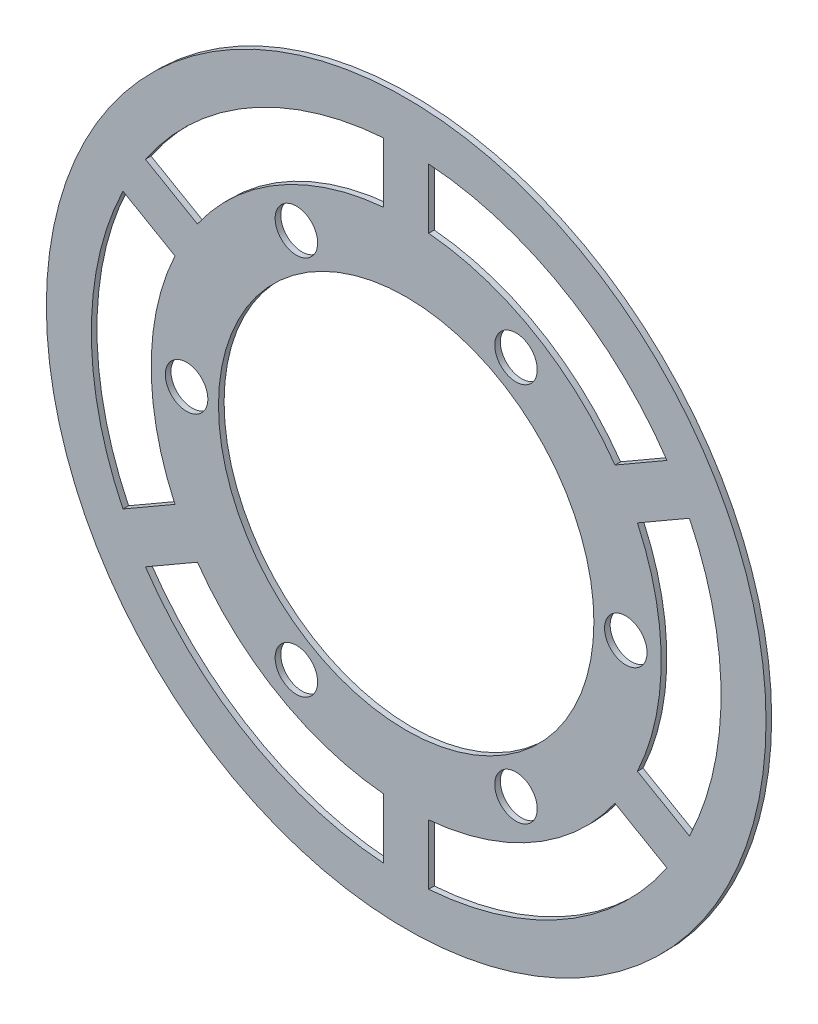
ISO-10303-21;
HEADER;
FILE_DESCRIPTION(('STEP AP214'),'2;1');
FILE_NAME('part.step','',(''),(''),'','','');
FILE_SCHEMA(('AUTOMOTIVE_DESIGN { 1 0 10303 214 1 1 1 1 }'));
ENDSEC;
DATA;
#1=APPLICATION_CONTEXT('core data for automotive mechanical design processes');
#2=APPLICATION_PROTOCOL_DEFINITION('international standard','automotive_design',2000,#1);
#3=PRODUCT_CONTEXT('',#1,'mechanical');
#4=PRODUCT('Part','Part','',(#3));
#5=PRODUCT_RELATED_PRODUCT_CATEGORY('part','',(#4));
#6=PRODUCT_DEFINITION_FORMATION('','',#4);
#7=PRODUCT_DEFINITION_CONTEXT('part definition',#1,'design');
#8=PRODUCT_DEFINITION('design','',#6,#7);
#9=PRODUCT_DEFINITION_SHAPE('','',#8);
#10=(LENGTH_UNIT() NAMED_UNIT(*) SI_UNIT(.MILLI.,.METRE.));
#11=(NAMED_UNIT(*) PLANE_ANGLE_UNIT() SI_UNIT($,.RADIAN.));
#12=(NAMED_UNIT(*) SI_UNIT($,.STERADIAN.) SOLID_ANGLE_UNIT());
#13=UNCERTAINTY_MEASURE_WITH_UNIT(LENGTH_MEASURE(1.E-05),#10,'distance_accuracy_value','');
#14=(GEOMETRIC_REPRESENTATION_CONTEXT(3) GLOBAL_UNCERTAINTY_ASSIGNED_CONTEXT((#13)) GLOBAL_UNIT_ASSIGNED_CONTEXT((#10,
#11,#12)) REPRESENTATION_CONTEXT('',''));
#15=CARTESIAN_POINT('',(0.,0.,0.));
#16=DIRECTION('',(0.,0.,1.));
#17=DIRECTION('',(1.,0.,0.));
#18=AXIS2_PLACEMENT_3D('',#15,#16,#17);
#19=CARTESIAN_POINT('',(0.,0.,0.396875));
#20=DIRECTION('',(0.,0.,-1.));
#21=DIRECTION('',(-1.,0.,0.));
#22=AXIS2_PLACEMENT_3D('',#19,#20,#21);
#23=CYLINDRICAL_SURFACE('',#22,22.225);
#24=CARTESIAN_POINT('',(0.,0.,0.));
#25=DIRECTION('',(0.,0.,1.));
#26=DIRECTION('',(1.,0.,0.));
#27=AXIS2_PLACEMENT_3D('',#24,#25,#26);
#28=CIRCLE('',#27,22.225);
#29=CARTESIAN_POINT('',(-19.9907523793972,9.71187130812728,0.));
#30=VERTEX_POINT('',#29);
#31=CARTESIAN_POINT('',(-19.9907523793972,-9.71187130812725,0.));
#32=VERTEX_POINT('',#31);
#33=EDGE_CURVE('E317',#30,#32,#28,.T.);
#34=ORIENTED_EDGE('',*,*,#33,.F.);
#35=DIRECTION('',(0.,0.,-1.));
#36=VECTOR('',#35,1.);
#37=CARTESIAN_POINT('',(-19.9907523793972,9.71187130812728,0.396875));
#38=LINE('',#37,#36);
#39=CARTESIAN_POINT('',(-19.9907523793972,9.71187130812728,0.396875));
#40=VERTEX_POINT('',#39);
#41=EDGE_CURVE('E11',#40,#30,#38,.T.);
#42=ORIENTED_EDGE('',*,*,#41,.F.);
#43=CARTESIAN_POINT('',(0.,0.,0.396875));
#44=DIRECTION('',(0.,0.,1.));
#45=DIRECTION('',(1.,0.,0.));
#46=AXIS2_PLACEMENT_3D('',#43,#44,#45);
#47=CIRCLE('',#46,22.225);
#48=CARTESIAN_POINT('',(-19.9907523793972,-9.71187130812725,0.396875));
#49=VERTEX_POINT('',#48);
#50=EDGE_CURVE('E226',#40,#49,#47,.T.);
#51=ORIENTED_EDGE('',*,*,#50,.T.);
#52=DIRECTION('',(0.,0.,-1.));
#53=VECTOR('',#52,1.);
#54=CARTESIAN_POINT('',(-19.9907523793972,-9.71187130812725,0.396875));
#55=LINE('',#54,#53);
#56=EDGE_CURVE('E139',#49,#32,#55,.T.);
#57=ORIENTED_EDGE('',*,*,#56,.T.);
#58=EDGE_LOOP('',(#34,#42,#51,#57));
#59=FACE_BOUND('',#58,.T.);
#60=ADVANCED_FACE('F37',(#59),#23,.F.);
#61=CARTESIAN_POINT('',(-0.792324459287639,-1.37234621956571,0.396875));
#62=DIRECTION('',(-0.500000000000004,-0.866025403784436,0.));
#63=DIRECTION('',(0.866025403784436,-0.500000000000004,0.));
#64=AXIS2_PLACEMENT_3D('',#61,#62,#63);
#65=PLANE('',#64);
#66=DIRECTION('',(-0.866025403784436,0.500000000000004,0.));
#67=VECTOR('',#66,1.);
#68=CARTESIAN_POINT('',(-0.792324459287639,-1.37234621956571,0.));
#69=LINE('',#68,#67);
#70=CARTESIAN_POINT('',(-16.3202562550434,7.59270938267211,0.));
#71=VERTEX_POINT('',#70);
#72=EDGE_CURVE('E215',#71,#30,#69,.T.);
#73=ORIENTED_EDGE('',*,*,#72,.F.);
#74=DIRECTION('',(0.,0.,-1.));
#75=VECTOR('',#74,1.);
#76=CARTESIAN_POINT('',(-16.3202562550434,7.59270938267211,0.396875));
#77=LINE('',#76,#75);
#78=CARTESIAN_POINT('',(-16.3202562550434,7.59270938267211,0.396875));
#79=VERTEX_POINT('',#78);
#80=EDGE_CURVE('E47',#79,#71,#77,.T.);
#81=ORIENTED_EDGE('',*,*,#80,.F.);
#82=DIRECTION('',(-0.866025403784436,0.500000000000004,0.));
#83=VECTOR('',#82,1.);
#84=CARTESIAN_POINT('',(-0.792324459287639,-1.37234621956571,0.396875));
#85=LINE('',#84,#83);
#86=EDGE_CURVE('E213',#79,#40,#85,.T.);
#87=ORIENTED_EDGE('',*,*,#86,.T.);
#88=ORIENTED_EDGE('',*,*,#41,.T.);
#89=EDGE_LOOP('',(#73,#81,#87,#88));
#90=FACE_BOUND('',#89,.T.);
#91=ADVANCED_FACE('F211',(#90),#65,.T.);
#92=CARTESIAN_POINT('',(0.,0.,0.396875));
#93=DIRECTION('',(0.,0.,-1.));
#94=DIRECTION('',(-1.,0.,0.));
#95=AXIS2_PLACEMENT_3D('',#92,#93,#94);
#96=CYLINDRICAL_SURFACE('',#95,18.);
#97=CARTESIAN_POINT('',(0.,0.,0.));
#98=DIRECTION('',(0.,0.,1.));
#99=DIRECTION('',(1.,0.,0.));
#100=AXIS2_PLACEMENT_3D('',#97,#98,#99);
#101=CIRCLE('',#100,18.);
#102=CARTESIAN_POINT('',(-16.3202562550434,-7.5927093826721,0.));
#103=VERTEX_POINT('',#102);
#104=EDGE_CURVE('E320',#71,#103,#101,.T.);
#105=ORIENTED_EDGE('',*,*,#104,.T.);
#106=DIRECTION('',(0.,0.,-1.));
#107=VECTOR('',#106,1.);
#108=CARTESIAN_POINT('',(-16.3202562550434,-7.5927093826721,0.396875));
#109=LINE('',#108,#107);
#110=CARTESIAN_POINT('',(-16.3202562550434,-7.5927093826721,0.396875));
#111=VERTEX_POINT('',#110);
#112=EDGE_CURVE('E218',#111,#103,#109,.T.);
#113=ORIENTED_EDGE('',*,*,#112,.F.);
#114=CARTESIAN_POINT('',(0.,0.,0.396875));
#115=DIRECTION('',(0.,0.,1.));
#116=DIRECTION('',(1.,0.,0.));
#117=AXIS2_PLACEMENT_3D('',#114,#115,#116);
#118=CIRCLE('',#117,18.);
#119=EDGE_CURVE('E221',#79,#111,#118,.T.);
#120=ORIENTED_EDGE('',*,*,#119,.F.);
#121=ORIENTED_EDGE('',*,*,#80,.T.);
#122=EDGE_LOOP('',(#105,#113,#120,#121));
#123=FACE_BOUND('',#122,.T.);
#124=ADVANCED_FACE('F222',(#123),#96,.T.);
#125=CARTESIAN_POINT('',(0.,0.,0.396875));
#126=DIRECTION('',(0.,0.,-1.));
#127=DIRECTION('',(-1.,0.,0.));
#128=AXIS2_PLACEMENT_3D('',#125,#126,#127);
#129=CYLINDRICAL_SURFACE('',#128,22.225);
#130=CARTESIAN_POINT('',(0.,0.,0.));
#131=DIRECTION('',(0.,0.,1.));
#132=DIRECTION('',(1.,0.,0.));
#133=AXIS2_PLACEMENT_3D('',#130,#131,#132);
#134=CIRCLE('',#133,22.225);
#135=CARTESIAN_POINT('',(-18.406103460822,-12.4565637472585,0.));
#136=VERTEX_POINT('',#135);
#137=CARTESIAN_POINT('',(-1.58464891857501,-22.1684350553858,0.));
#138=VERTEX_POINT('',#137);
#139=EDGE_CURVE('E284',#136,#138,#134,.T.);
#140=ORIENTED_EDGE('',*,*,#139,.F.);
#141=DIRECTION('',(0.,0.,-1.));
#142=VECTOR('',#141,1.);
#143=CARTESIAN_POINT('',(-18.406103460822,-12.4565637472585,0.396875));
#144=LINE('',#143,#142);
#145=CARTESIAN_POINT('',(-18.406103460822,-12.4565637472585,0.396875));
#146=VERTEX_POINT('',#145);
#147=EDGE_CURVE('E328',#146,#136,#144,.T.);
#148=ORIENTED_EDGE('',*,*,#147,.F.);
#149=CARTESIAN_POINT('',(0.,0.,0.396875));
#150=DIRECTION('',(0.,0.,1.));
#151=DIRECTION('',(1.,0.,0.));
#152=AXIS2_PLACEMENT_3D('',#149,#150,#151);
#153=CIRCLE('',#152,22.225);
#154=CARTESIAN_POINT('',(-1.58464891857501,-22.1684350553858,0.396875));
#155=VERTEX_POINT('',#154);
#156=EDGE_CURVE('E428',#146,#155,#153,.T.);
#157=ORIENTED_EDGE('',*,*,#156,.T.);
#158=DIRECTION('',(0.,0.,-1.));
#159=VECTOR('',#158,1.);
#160=CARTESIAN_POINT('',(-1.58464891857501,-22.1684350553858,0.396875));
#161=LINE('',#160,#159);
#162=EDGE_CURVE('E330',#155,#138,#161,.T.);
#163=ORIENTED_EDGE('',*,*,#162,.T.);
#164=EDGE_LOOP('',(#140,#148,#157,#163));
#165=FACE_BOUND('',#164,.T.);
#166=ADVANCED_FACE('F521',(#165),#129,.F.);
#167=CARTESIAN_POINT('',(0.792324459287577,-1.37234621956563,0.396875));
#168=DIRECTION('',(0.499999999999999,-0.866025403784439,0.));
#169=DIRECTION('',(0.86602540378444,0.499999999999999,0.));
#170=AXIS2_PLACEMENT_3D('',#167,#168,#169);
#171=PLANE('',#170);
#172=DIRECTION('',(-0.86602540378444,-0.499999999999999,0.));
#173=VECTOR('',#172,1.);
#174=CARTESIAN_POINT('',(0.792324459287577,-1.37234621956563,0.));
#175=LINE('',#174,#173);
#176=CARTESIAN_POINT('',(-14.7356073364682,-10.3374018218034,0.));
#177=VERTEX_POINT('',#176);
#178=EDGE_CURVE('E287',#177,#136,#175,.T.);
#179=ORIENTED_EDGE('',*,*,#178,.F.);
#180=DIRECTION('',(0.,0.,-1.));
#181=VECTOR('',#180,1.);
#182=CARTESIAN_POINT('',(-14.7356073364682,-10.3374018218034,0.396875));
#183=LINE('',#182,#181);
#184=CARTESIAN_POINT('',(-14.7356073364682,-10.3374018218034,0.396875));
#185=VERTEX_POINT('',#184);
#186=EDGE_CURVE('E336',#185,#177,#183,.T.);
#187=ORIENTED_EDGE('',*,*,#186,.F.);
#188=DIRECTION('',(-0.86602540378444,-0.499999999999999,0.));
#189=VECTOR('',#188,1.);
#190=CARTESIAN_POINT('',(0.792324459287577,-1.37234621956563,0.396875));
#191=LINE('',#190,#189);
#192=EDGE_CURVE('E431',#185,#146,#191,.T.);
#193=ORIENTED_EDGE('',*,*,#192,.T.);
#194=ORIENTED_EDGE('',*,*,#147,.T.);
#195=EDGE_LOOP('',(#179,#187,#193,#194));
#196=FACE_BOUND('',#195,.T.);
#197=ADVANCED_FACE('F517',(#196),#171,.T.);
#198=CARTESIAN_POINT('',(0.,0.,0.396875));
#199=DIRECTION('',(0.,0.,-1.));
#200=DIRECTION('',(-1.,0.,0.));
#201=AXIS2_PLACEMENT_3D('',#198,#199,#200);
#202=CYLINDRICAL_SURFACE('',#201,18.);
#203=CARTESIAN_POINT('',(0.,0.,0.));
#204=DIRECTION('',(0.,0.,1.));
#205=DIRECTION('',(1.,0.,0.));
#206=AXIS2_PLACEMENT_3D('',#203,#204,#205);
#207=CIRCLE('',#206,18.);
#208=CARTESIAN_POINT('',(-1.58464891857501,-17.9301112044755,0.));
#209=VERTEX_POINT('',#208);
#210=EDGE_CURVE('E290',#177,#209,#207,.T.);
#211=ORIENTED_EDGE('',*,*,#210,.T.);
#212=DIRECTION('',(0.,0.,-1.));
#213=VECTOR('',#212,1.);
#214=CARTESIAN_POINT('',(-1.58464891857501,-17.9301112044755,0.396875));
#215=LINE('',#214,#213);
#216=CARTESIAN_POINT('',(-1.58464891857501,-17.9301112044755,0.396875));
#217=VERTEX_POINT('',#216);
#218=EDGE_CURVE('E332',#217,#209,#215,.T.);
#219=ORIENTED_EDGE('',*,*,#218,.F.);
#220=CARTESIAN_POINT('',(0.,0.,0.396875));
#221=DIRECTION('',(0.,0.,1.));
#222=DIRECTION('',(1.,0.,0.));
#223=AXIS2_PLACEMENT_3D('',#220,#221,#222);
#224=CIRCLE('',#223,18.);
#225=EDGE_CURVE('E434',#185,#217,#224,.T.);
#226=ORIENTED_EDGE('',*,*,#225,.F.);
#227=ORIENTED_EDGE('',*,*,#186,.T.);
#228=EDGE_LOOP('',(#211,#219,#226,#227));
#229=FACE_BOUND('',#228,.T.);
#230=ADVANCED_FACE('F513',(#229),#202,.T.);
#231=CARTESIAN_POINT('',(0.,0.,0.396875));
#232=DIRECTION('',(0.,0.,-1.));
#233=DIRECTION('',(-1.,0.,0.));
#234=AXIS2_PLACEMENT_3D('',#231,#232,#233);
#235=CYLINDRICAL_SURFACE('',#234,22.225);
#236=CARTESIAN_POINT('',(0.,0.,0.));
#237=DIRECTION('',(0.,0.,1.));
#238=DIRECTION('',(1.,0.,0.));
#239=AXIS2_PLACEMENT_3D('',#236,#237,#238);
#240=CIRCLE('',#239,22.225);
#241=CARTESIAN_POINT('',(1.58464891857501,-22.1684350553858,0.));
#242=VERTEX_POINT('',#241);
#243=CARTESIAN_POINT('',(18.4061034608221,-12.4565637472584,0.));
#244=VERTEX_POINT('',#243);
#245=EDGE_CURVE('E272',#242,#244,#240,.T.);
#246=ORIENTED_EDGE('',*,*,#245,.F.);
#247=DIRECTION('',(0.,0.,-1.));
#248=VECTOR('',#247,1.);
#249=CARTESIAN_POINT('',(1.58464891857501,-22.1684350553858,0.396875));
#250=LINE('',#249,#248);
#251=CARTESIAN_POINT('',(1.58464891857501,-22.1684350553858,0.396875));
#252=VERTEX_POINT('',#251);
#253=EDGE_CURVE('E333',#252,#242,#250,.T.);
#254=ORIENTED_EDGE('',*,*,#253,.F.);
#255=CARTESIAN_POINT('',(0.,0.,0.396875));
#256=DIRECTION('',(0.,0.,1.));
#257=DIRECTION('',(1.,0.,0.));
#258=AXIS2_PLACEMENT_3D('',#255,#256,#257);
#259=CIRCLE('',#258,22.225);
#260=CARTESIAN_POINT('',(18.4061034608221,-12.4565637472584,0.396875));
#261=VERTEX_POINT('',#260);
#262=EDGE_CURVE('E417',#252,#261,#259,.T.);
#263=ORIENTED_EDGE('',*,*,#262,.T.);
#264=DIRECTION('',(0.,0.,-1.));
#265=VECTOR('',#264,1.);
#266=CARTESIAN_POINT('',(18.4061034608221,-12.4565637472584,0.396875));
#267=LINE('',#266,#265);
#268=EDGE_CURVE('E339',#261,#244,#267,.T.);
#269=ORIENTED_EDGE('',*,*,#268,.T.);
#270=EDGE_LOOP('',(#246,#254,#263,#269));
#271=FACE_BOUND('',#270,.T.);
#272=ADVANCED_FACE('F516',(#271),#235,.F.);
#273=CARTESIAN_POINT('',(1.58464891857562,0.,0.396875));
#274=DIRECTION('',(1.,0.,0.));
#275=DIRECTION('',(0.,1.,0.));
#276=AXIS2_PLACEMENT_3D('',#273,#274,#275);
#277=PLANE('',#276);
#278=DIRECTION('',(0.,-1.,0.));
#279=VECTOR('',#278,1.);
#280=CARTESIAN_POINT('',(1.58464891857562,0.,0.));
#281=LINE('',#280,#279);
#282=CARTESIAN_POINT('',(1.58464891857513,-17.9301112044755,0.));
#283=VERTEX_POINT('',#282);
#284=EDGE_CURVE('E275',#283,#242,#281,.T.);
#285=ORIENTED_EDGE('',*,*,#284,.F.);
#286=DIRECTION('',(0.,0.,-1.));
#287=VECTOR('',#286,1.);
#288=CARTESIAN_POINT('',(1.58464891857513,-17.9301112044755,0.396875));
#289=LINE('',#288,#287);
#290=CARTESIAN_POINT('',(1.58464891857513,-17.9301112044755,0.396875));
#291=VERTEX_POINT('',#290);
#292=EDGE_CURVE('E345',#291,#283,#289,.T.);
#293=ORIENTED_EDGE('',*,*,#292,.F.);
#294=DIRECTION('',(0.,-1.,0.));
#295=VECTOR('',#294,1.);
#296=CARTESIAN_POINT('',(1.58464891857562,0.,0.396875));
#297=LINE('',#296,#295);
#298=EDGE_CURVE('E420',#291,#252,#297,.T.);
#299=ORIENTED_EDGE('',*,*,#298,.T.);
#300=ORIENTED_EDGE('',*,*,#253,.T.);
#301=EDGE_LOOP('',(#285,#293,#299,#300));
#302=FACE_BOUND('',#301,.T.);
#303=ADVANCED_FACE('F534',(#302),#277,.T.);
#304=CARTESIAN_POINT('',(0.,0.,0.396875));
#305=DIRECTION('',(0.,0.,-1.));
#306=DIRECTION('',(-1.,0.,0.));
#307=AXIS2_PLACEMENT_3D('',#304,#305,#306);
#308=CYLINDRICAL_SURFACE('',#307,18.);
#309=CARTESIAN_POINT('',(0.,0.,0.));
#310=DIRECTION('',(0.,0.,1.));
#311=DIRECTION('',(1.,0.,0.));
#312=AXIS2_PLACEMENT_3D('',#309,#310,#311);
#313=CIRCLE('',#312,18.);
#314=CARTESIAN_POINT('',(14.7356073364683,-10.3374018218032,0.));
#315=VERTEX_POINT('',#314);
#316=EDGE_CURVE('E278',#283,#315,#313,.T.);
#317=ORIENTED_EDGE('',*,*,#316,.T.);
#318=DIRECTION('',(0.,0.,-1.));
#319=VECTOR('',#318,1.);
#320=CARTESIAN_POINT('',(14.7356073364683,-10.3374018218032,0.396875));
#321=LINE('',#320,#319);
#322=CARTESIAN_POINT('',(14.7356073364683,-10.3374018218032,0.396875));
#323=VERTEX_POINT('',#322);
#324=EDGE_CURVE('E341',#323,#315,#321,.T.);
#325=ORIENTED_EDGE('',*,*,#324,.F.);
#326=CARTESIAN_POINT('',(0.,0.,0.396875));
#327=DIRECTION('',(0.,0.,1.));
#328=DIRECTION('',(1.,0.,0.));
#329=AXIS2_PLACEMENT_3D('',#326,#327,#328);
#330=CIRCLE('',#329,18.);
#331=EDGE_CURVE('E423',#291,#323,#330,.T.);
#332=ORIENTED_EDGE('',*,*,#331,.F.);
#333=ORIENTED_EDGE('',*,*,#292,.T.);
#334=EDGE_LOOP('',(#317,#325,#332,#333));
#335=FACE_BOUND('',#334,.T.);
#336=ADVANCED_FACE('F530',(#335),#308,.T.);
#337=CARTESIAN_POINT('',(0.,0.,0.396875));
#338=DIRECTION('',(0.,0.,-1.));
#339=DIRECTION('',(-1.,0.,0.));
#340=AXIS2_PLACEMENT_3D('',#337,#338,#339);
#341=CYLINDRICAL_SURFACE('',#340,22.225);
#342=CARTESIAN_POINT('',(0.,0.,0.));
#343=DIRECTION('',(0.,0.,1.));
#344=DIRECTION('',(1.,0.,0.));
#345=AXIS2_PLACEMENT_3D('',#342,#343,#344);
#346=CIRCLE('',#345,22.225);
#347=CARTESIAN_POINT('',(19.990752379397,-9.71187130812762,0.));
#348=VERTEX_POINT('',#347);
#349=CARTESIAN_POINT('',(19.9907523793971,9.71187130812751,0.));
#350=VERTEX_POINT('',#349);
#351=EDGE_CURVE('E260',#348,#350,#346,.T.);
#352=ORIENTED_EDGE('',*,*,#351,.F.);
#353=DIRECTION('',(0.,0.,-1.));
#354=VECTOR('',#353,1.);
#355=CARTESIAN_POINT('',(19.990752379397,-9.71187130812762,0.396875));
#356=LINE('',#355,#354);
#357=CARTESIAN_POINT('',(19.990752379397,-9.71187130812762,0.396875));
#358=VERTEX_POINT('',#357);
#359=EDGE_CURVE('E342',#358,#348,#356,.T.);
#360=ORIENTED_EDGE('',*,*,#359,.F.);
#361=CARTESIAN_POINT('',(0.,0.,0.396875));
#362=DIRECTION('',(0.,0.,1.));
#363=DIRECTION('',(1.,0.,0.));
#364=AXIS2_PLACEMENT_3D('',#361,#362,#363);
#365=CIRCLE('',#364,22.225);
#366=CARTESIAN_POINT('',(19.9907523793971,9.71187130812751,0.396875));
#367=VERTEX_POINT('',#366);
#368=EDGE_CURVE('E406',#358,#367,#365,.T.);
#369=ORIENTED_EDGE('',*,*,#368,.T.);
#370=DIRECTION('',(0.,0.,-1.));
#371=VECTOR('',#370,1.);
#372=CARTESIAN_POINT('',(19.9907523793971,9.71187130812751,0.396875));
#373=LINE('',#372,#371);
#374=EDGE_CURVE('E348',#367,#350,#373,.T.);
#375=ORIENTED_EDGE('',*,*,#374,.T.);
#376=EDGE_LOOP('',(#352,#360,#369,#375));
#377=FACE_BOUND('',#376,.T.);
#378=ADVANCED_FACE('F533',(#377),#341,.F.);
#379=CARTESIAN_POINT('',(0.792324459287454,1.37234621956539,0.396875));
#380=DIRECTION('',(0.500000000000004,0.866025403784436,0.));
#381=DIRECTION('',(-0.866025403784436,0.500000000000004,0.));
#382=AXIS2_PLACEMENT_3D('',#379,#380,#381);
#383=PLANE('',#382);
#384=DIRECTION('',(0.866025403784436,-0.500000000000004,0.));
#385=VECTOR('',#384,1.);
#386=CARTESIAN_POINT('',(0.792324459287454,1.37234621956539,0.));
#387=LINE('',#386,#385);
#388=CARTESIAN_POINT('',(16.3202562550432,-7.59270938267245,0.));
#389=VERTEX_POINT('',#388);
#390=EDGE_CURVE('E263',#389,#348,#387,.T.);
#391=ORIENTED_EDGE('',*,*,#390,.F.);
#392=DIRECTION('',(0.,0.,-1.));
#393=VECTOR('',#392,1.);
#394=CARTESIAN_POINT('',(16.3202562550432,-7.59270938267245,0.396875));
#395=LINE('',#394,#393);
#396=CARTESIAN_POINT('',(16.3202562550432,-7.59270938267245,0.396875));
#397=VERTEX_POINT('',#396);
#398=EDGE_CURVE('E354',#397,#389,#395,.T.);
#399=ORIENTED_EDGE('',*,*,#398,.F.);
#400=DIRECTION('',(0.866025403784436,-0.500000000000004,0.));
#401=VECTOR('',#400,1.);
#402=CARTESIAN_POINT('',(0.792324459287454,1.37234621956539,0.396875));
#403=LINE('',#402,#401);
#404=EDGE_CURVE('E409',#397,#358,#403,.T.);
#405=ORIENTED_EDGE('',*,*,#404,.T.);
#406=ORIENTED_EDGE('',*,*,#359,.T.);
#407=EDGE_LOOP('',(#391,#399,#405,#406));
#408=FACE_BOUND('',#407,.T.);
#409=ADVANCED_FACE('F550',(#408),#383,.T.);
#410=CARTESIAN_POINT('',(0.,0.,0.396875));
#411=DIRECTION('',(0.,0.,-1.));
#412=DIRECTION('',(-1.,0.,0.));
#413=AXIS2_PLACEMENT_3D('',#410,#411,#412);
#414=CYLINDRICAL_SURFACE('',#413,18.);
#415=CARTESIAN_POINT('',(0.,0.,0.));
#416=DIRECTION('',(0.,0.,1.));
#417=DIRECTION('',(1.,0.,0.));
#418=AXIS2_PLACEMENT_3D('',#415,#416,#417);
#419=CIRCLE('',#418,18.);
#420=CARTESIAN_POINT('',(16.3202562550433,7.59270938267237,0.));
#421=VERTEX_POINT('',#420);
#422=EDGE_CURVE('E266',#389,#421,#419,.T.);
#423=ORIENTED_EDGE('',*,*,#422,.T.);
#424=DIRECTION('',(0.,0.,-1.));
#425=VECTOR('',#424,1.);
#426=CARTESIAN_POINT('',(16.3202562550433,7.59270938267237,0.396875));
#427=LINE('',#426,#425);
#428=CARTESIAN_POINT('',(16.3202562550433,7.59270938267237,0.396875));
#429=VERTEX_POINT('',#428);
#430=EDGE_CURVE('E350',#429,#421,#427,.T.);
#431=ORIENTED_EDGE('',*,*,#430,.F.);
#432=CARTESIAN_POINT('',(0.,0.,0.396875));
#433=DIRECTION('',(0.,0.,1.));
#434=DIRECTION('',(1.,0.,0.));
#435=AXIS2_PLACEMENT_3D('',#432,#433,#434);
#436=CIRCLE('',#435,18.);
#437=EDGE_CURVE('E412',#397,#429,#436,.T.);
#438=ORIENTED_EDGE('',*,*,#437,.F.);
#439=ORIENTED_EDGE('',*,*,#398,.T.);
#440=EDGE_LOOP('',(#423,#431,#438,#439));
#441=FACE_BOUND('',#440,.T.);
#442=ADVANCED_FACE('F546',(#441),#414,.T.);
#443=CARTESIAN_POINT('',(0.,0.,0.396875));
#444=DIRECTION('',(0.,0.,-1.));
#445=DIRECTION('',(-1.,0.,0.));
#446=AXIS2_PLACEMENT_3D('',#443,#444,#445);
#447=CYLINDRICAL_SURFACE('',#446,22.225);
#448=CARTESIAN_POINT('',(0.,0.,0.));
#449=DIRECTION('',(0.,0.,1.));
#450=DIRECTION('',(1.,0.,0.));
#451=AXIS2_PLACEMENT_3D('',#448,#449,#450);
#452=CIRCLE('',#451,22.225);
#453=CARTESIAN_POINT('',(18.4061034608222,12.4565637472583,0.));
#454=VERTEX_POINT('',#453);
#455=CARTESIAN_POINT('',(1.58464891857517,22.1684350553858,0.));
#456=VERTEX_POINT('',#455);
#457=EDGE_CURVE('E248',#454,#456,#452,.T.);
#458=ORIENTED_EDGE('',*,*,#457,.F.);
#459=DIRECTION('',(0.,0.,-1.));
#460=VECTOR('',#459,1.);
#461=CARTESIAN_POINT('',(18.4061034608222,12.4565637472583,0.396875));
#462=LINE('',#461,#460);
#463=CARTESIAN_POINT('',(18.4061034608222,12.4565637472583,0.396875));
#464=VERTEX_POINT('',#463);
#465=EDGE_CURVE('E351',#464,#454,#462,.T.);
#466=ORIENTED_EDGE('',*,*,#465,.F.);
#467=CARTESIAN_POINT('',(0.,0.,0.396875));
#468=DIRECTION('',(0.,0.,1.));
#469=DIRECTION('',(1.,0.,0.));
#470=AXIS2_PLACEMENT_3D('',#467,#468,#469);
#471=CIRCLE('',#470,22.225);
#472=CARTESIAN_POINT('',(1.58464891857517,22.1684350553858,0.396875));
#473=VERTEX_POINT('',#472);
#474=EDGE_CURVE('E390',#464,#473,#471,.T.);
#475=ORIENTED_EDGE('',*,*,#474,.T.);
#476=DIRECTION('',(0.,0.,-1.));
#477=VECTOR('',#476,1.);
#478=CARTESIAN_POINT('',(1.58464891857517,22.1684350553858,0.396875));
#479=LINE('',#478,#477);
#480=EDGE_CURVE('E357',#473,#456,#479,.T.);
#481=ORIENTED_EDGE('',*,*,#480,.T.);
#482=EDGE_LOOP('',(#458,#466,#475,#481));
#483=FACE_BOUND('',#482,.T.);
#484=ADVANCED_FACE('F549',(#483),#447,.F.);
#485=CARTESIAN_POINT('',(-0.792324459287421,1.37234621956536,0.396875));
#486=DIRECTION('',(-0.499999999999999,0.866025403784439,0.));
#487=DIRECTION('',(-0.866025403784439,-0.499999999999999,0.));
#488=AXIS2_PLACEMENT_3D('',#485,#486,#487);
#489=PLANE('',#488);
#490=DIRECTION('',(0.866025403784439,0.499999999999999,0.));
#491=VECTOR('',#490,1.);
#492=CARTESIAN_POINT('',(-0.792324459287421,1.37234621956536,0.));
#493=LINE('',#492,#491);
#494=CARTESIAN_POINT('',(14.7356073364684,10.3374018218031,0.));
#495=VERTEX_POINT('',#494);
#496=EDGE_CURVE('E251',#495,#454,#493,.T.);
#497=ORIENTED_EDGE('',*,*,#496,.F.);
#498=DIRECTION('',(0.,0.,-1.));
#499=VECTOR('',#498,1.);
#500=CARTESIAN_POINT('',(14.7356073364684,10.3374018218031,0.396875));
#501=LINE('',#500,#499);
#502=CARTESIAN_POINT('',(14.7356073364684,10.3374018218031,0.396875));
#503=VERTEX_POINT('',#502);
#504=EDGE_CURVE('E362',#503,#495,#501,.T.);
#505=ORIENTED_EDGE('',*,*,#504,.F.);
#506=DIRECTION('',(0.866025403784439,0.499999999999999,0.));
#507=VECTOR('',#506,1.);
#508=CARTESIAN_POINT('',(-0.792324459287421,1.37234621956536,0.396875));
#509=LINE('',#508,#507);
#510=EDGE_CURVE('E394',#503,#464,#509,.T.);
#511=ORIENTED_EDGE('',*,*,#510,.T.);
#512=ORIENTED_EDGE('',*,*,#465,.T.);
#513=EDGE_LOOP('',(#497,#505,#511,#512));
#514=FACE_BOUND('',#513,.T.);
#515=ADVANCED_FACE('F564',(#514),#489,.T.);
#516=CARTESIAN_POINT('',(0.,0.,0.396875));
#517=DIRECTION('',(0.,0.,-1.));
#518=DIRECTION('',(-1.,0.,0.));
#519=AXIS2_PLACEMENT_3D('',#516,#517,#518);
#520=CYLINDRICAL_SURFACE('',#519,18.);
#521=CARTESIAN_POINT('',(0.,0.,0.));
#522=DIRECTION('',(0.,0.,1.));
#523=DIRECTION('',(1.,0.,0.));
#524=AXIS2_PLACEMENT_3D('',#521,#522,#523);
#525=CIRCLE('',#524,18.);
#526=CARTESIAN_POINT('',(1.58464891857517,17.9301112044755,0.));
#527=VERTEX_POINT('',#526);
#528=EDGE_CURVE('E254',#495,#527,#525,.T.);
#529=ORIENTED_EDGE('',*,*,#528,.T.);
#530=DIRECTION('',(0.,0.,-1.));
#531=VECTOR('',#530,1.);
#532=CARTESIAN_POINT('',(1.58464891857517,17.9301112044755,0.396875));
#533=LINE('',#532,#531);
#534=CARTESIAN_POINT('',(1.58464891857517,17.9301112044755,0.396875));
#535=VERTEX_POINT('',#534);
#536=EDGE_CURVE('E359',#535,#527,#533,.T.);
#537=ORIENTED_EDGE('',*,*,#536,.F.);
#538=CARTESIAN_POINT('',(0.,0.,0.396875));
#539=DIRECTION('',(0.,0.,1.));
#540=DIRECTION('',(1.,0.,0.));
#541=AXIS2_PLACEMENT_3D('',#538,#539,#540);
#542=CIRCLE('',#541,18.);
#543=EDGE_CURVE('E401',#503,#535,#542,.T.);
#544=ORIENTED_EDGE('',*,*,#543,.F.);
#545=ORIENTED_EDGE('',*,*,#504,.T.);
#546=EDGE_LOOP('',(#529,#537,#544,#545));
#547=FACE_BOUND('',#546,.T.);
#548=ADVANCED_FACE('F561',(#547),#520,.T.);
#549=CARTESIAN_POINT('',(0.,0.,0.396875));
#550=DIRECTION('',(0.,0.,-1.));
#551=DIRECTION('',(-1.,0.,0.));
#552=AXIS2_PLACEMENT_3D('',#549,#550,#551);
#553=CYLINDRICAL_SURFACE('',#552,22.225);
#554=CARTESIAN_POINT('',(0.,0.,0.));
#555=DIRECTION('',(0.,0.,1.));
#556=DIRECTION('',(1.,0.,0.));
#557=AXIS2_PLACEMENT_3D('',#554,#555,#556);
#558=CIRCLE('',#557,22.225);
#559=CARTESIAN_POINT('',(-1.58464891857517,22.1684350553858,0.));
#560=VERTEX_POINT('',#559);
#561=CARTESIAN_POINT('',(-18.4061034608219,12.4565637472587,0.));
#562=VERTEX_POINT('',#561);
#563=EDGE_CURVE('E237',#560,#562,#558,.T.);
#564=ORIENTED_EDGE('',*,*,#563,.F.);
#565=DIRECTION('',(0.,0.,-1.));
#566=VECTOR('',#565,1.);
#567=CARTESIAN_POINT('',(-1.58464891857517,22.1684350553858,0.396875));
#568=LINE('',#567,#566);
#569=CARTESIAN_POINT('',(-1.58464891857517,22.1684350553858,0.396875));
#570=VERTEX_POINT('',#569);
#571=EDGE_CURVE('E41',#570,#560,#568,.T.);
#572=ORIENTED_EDGE('',*,*,#571,.F.);
#573=CARTESIAN_POINT('',(0.,0.,0.396875));
#574=DIRECTION('',(0.,0.,1.));
#575=DIRECTION('',(1.,0.,0.));
#576=AXIS2_PLACEMENT_3D('',#573,#574,#575);
#577=CIRCLE('',#576,22.225);
#578=CARTESIAN_POINT('',(-18.4061034608219,12.4565637472587,0.396875));
#579=VERTEX_POINT('',#578);
#580=EDGE_CURVE('E326',#570,#579,#577,.T.);
#581=ORIENTED_EDGE('',*,*,#580,.T.);
#582=DIRECTION('',(0.,0.,-1.));
#583=VECTOR('',#582,1.);
#584=CARTESIAN_POINT('',(-18.4061034608219,12.4565637472587,0.396875));
#585=LINE('',#584,#583);
#586=EDGE_CURVE('E236',#579,#562,#585,.T.);
#587=ORIENTED_EDGE('',*,*,#586,.T.);
#588=EDGE_LOOP('',(#564,#572,#581,#587));
#589=FACE_BOUND('',#588,.T.);
#590=ADVANCED_FACE('F39',(#589),#553,.F.);
#591=CARTESIAN_POINT('',(-1.58464891857517,0.,0.396875));
#592=DIRECTION('',(-1.,0.,0.));
#593=DIRECTION('',(0.,-1.,0.));
#594=AXIS2_PLACEMENT_3D('',#591,#592,#593);
#595=PLANE('',#594);
#596=DIRECTION('',(0.,1.,0.));
#597=VECTOR('',#596,1.);
#598=CARTESIAN_POINT('',(-1.58464891857517,0.,0.));
#599=LINE('',#598,#597);
#600=CARTESIAN_POINT('',(-1.58464891857517,17.9301112044755,0.));
#601=VERTEX_POINT('',#600);
#602=EDGE_CURVE('E240',#601,#560,#599,.T.);
#603=ORIENTED_EDGE('',*,*,#602,.F.);
#604=DIRECTION('',(0.,0.,-1.));
#605=VECTOR('',#604,1.);
#606=CARTESIAN_POINT('',(-1.58464891857517,17.9301112044755,0.396875));
#607=LINE('',#606,#605);
#608=CARTESIAN_POINT('',(-1.58464891857517,17.9301112044755,0.396875));
#609=VERTEX_POINT('',#608);
#610=EDGE_CURVE('E368',#609,#601,#607,.T.);
#611=ORIENTED_EDGE('',*,*,#610,.F.);
#612=DIRECTION('',(0.,1.,0.));
#613=VECTOR('',#612,1.);
#614=CARTESIAN_POINT('',(-1.58464891857517,0.,0.396875));
#615=LINE('',#614,#613);
#616=EDGE_CURVE('E377',#609,#570,#615,.T.);
#617=ORIENTED_EDGE('',*,*,#616,.T.);
#618=ORIENTED_EDGE('',*,*,#571,.T.);
#619=EDGE_LOOP('',(#603,#611,#617,#618));
#620=FACE_BOUND('',#619,.T.);
#621=ADVANCED_FACE('F375',(#620),#595,.T.);
#622=CARTESIAN_POINT('',(0.,0.,0.396875));
#623=DIRECTION('',(0.,0.,-1.));
#624=DIRECTION('',(-1.,0.,0.));
#625=AXIS2_PLACEMENT_3D('',#622,#623,#624);
#626=CYLINDRICAL_SURFACE('',#625,18.);
#627=CARTESIAN_POINT('',(0.,0.,0.));
#628=DIRECTION('',(0.,0.,1.));
#629=DIRECTION('',(1.,0.,0.));
#630=AXIS2_PLACEMENT_3D('',#627,#628,#629);
#631=CIRCLE('',#630,18.);
#632=CARTESIAN_POINT('',(-14.7356073364681,10.3374018218036,0.));
#633=VERTEX_POINT('',#632);
#634=EDGE_CURVE('E243',#601,#633,#631,.T.);
#635=ORIENTED_EDGE('',*,*,#634,.T.);
#636=DIRECTION('',(0.,0.,-1.));
#637=VECTOR('',#636,1.);
#638=CARTESIAN_POINT('',(-14.7356073364681,10.3374018218036,0.396875));
#639=LINE('',#638,#637);
#640=CARTESIAN_POINT('',(-14.7356073364681,10.3374018218036,0.396875));
#641=VERTEX_POINT('',#640);
#642=EDGE_CURVE('E366',#641,#633,#639,.T.);
#643=ORIENTED_EDGE('',*,*,#642,.F.);
#644=CARTESIAN_POINT('',(0.,0.,0.396875));
#645=DIRECTION('',(0.,0.,1.));
#646=DIRECTION('',(1.,0.,0.));
#647=AXIS2_PLACEMENT_3D('',#644,#645,#646);
#648=CIRCLE('',#647,18.);
#649=EDGE_CURVE('E391',#609,#641,#648,.T.);
#650=ORIENTED_EDGE('',*,*,#649,.F.);
#651=ORIENTED_EDGE('',*,*,#610,.T.);
#652=EDGE_LOOP('',(#635,#643,#650,#651));
#653=FACE_BOUND('',#652,.T.);
#654=ADVANCED_FACE('F384',(#653),#626,.T.);
#655=CARTESIAN_POINT('',(-0.792324459287585,1.37234621956564,0.396875));
#656=DIRECTION('',(0.499999999999999,-0.866025403784439,0.));
#657=DIRECTION('',(0.866025403784439,0.499999999999999,0.));
#658=AXIS2_PLACEMENT_3D('',#655,#656,#657);
#659=PLANE('',#658);
#660=DIRECTION('',(-0.866025403784439,-0.499999999999999,0.));
#661=VECTOR('',#660,1.);
#662=CARTESIAN_POINT('',(-0.792324459287585,1.37234621956564,0.));
#663=LINE('',#662,#661);
#664=EDGE_CURVE('E132',#103,#32,#663,.T.);
#665=ORIENTED_EDGE('',*,*,#664,.T.);
#666=ORIENTED_EDGE('',*,*,#56,.F.);
#667=DIRECTION('',(-0.866025403784439,-0.499999999999999,0.));
#668=VECTOR('',#667,1.);
#669=CARTESIAN_POINT('',(-0.792324459287585,1.37234621956564,0.396875));
#670=LINE('',#669,#668);
#671=EDGE_CURVE('E56',#111,#49,#670,.T.);
#672=ORIENTED_EDGE('',*,*,#671,.F.);
#673=ORIENTED_EDGE('',*,*,#112,.T.);
#674=EDGE_LOOP('',(#665,#666,#672,#673));
#675=FACE_BOUND('',#674,.T.);
#676=ADVANCED_FACE('F484',(#675),#659,.F.);
#677=CARTESIAN_POINT('',(0.,0.,0.396875));
#678=DIRECTION('',(0.,0.,-1.));
#679=DIRECTION('',(-1.,0.,0.));
#680=AXIS2_PLACEMENT_3D('',#677,#678,#679);
#681=CYLINDRICAL_SURFACE('',#680,13.25);
#682=CARTESIAN_POINT('',(0.,0.,0.396875));
#683=DIRECTION('',(0.,0.,1.));
#684=DIRECTION('',(1.,0.,0.));
#685=AXIS2_PLACEMENT_3D('',#682,#683,#684);
#686=CIRCLE('',#685,13.25);
#687=CARTESIAN_POINT('',(13.25,0.,0.396875));
#688=VERTEX_POINT('',#687);
#689=EDGE_CURVE('E228',#688,#688,#686,.T.);
#690=ORIENTED_EDGE('',*,*,#689,.T.);
#691=EDGE_LOOP('',(#690));
#692=FACE_BOUND('',#691,.T.);
#693=CARTESIAN_POINT('',(0.,0.,0.));
#694=DIRECTION('',(0.,0.,1.));
#695=DIRECTION('',(1.,0.,0.));
#696=AXIS2_PLACEMENT_3D('',#693,#694,#695);
#697=CIRCLE('',#696,13.25);
#698=CARTESIAN_POINT('',(13.25,0.,0.));
#699=VERTEX_POINT('',#698);
#700=EDGE_CURVE('E314',#699,#699,#697,.T.);
#701=ORIENTED_EDGE('',*,*,#700,.F.);
#702=EDGE_LOOP('',(#701));
#703=FACE_BOUND('',#702,.T.);
#704=ADVANCED_FACE('F459',(#692,#703),#681,.F.);
#705=CARTESIAN_POINT('',(-7.74999999999999,-13.4233937586588,0.396875));
#706=DIRECTION('',(0.,0.,-1.));
#707=DIRECTION('',(-1.,0.,0.));
#708=AXIS2_PLACEMENT_3D('',#705,#706,#707);
#709=CYLINDRICAL_SURFACE('',#708,1.5);
#710=CARTESIAN_POINT('',(-7.74999999999999,-13.4233937586588,0.396875));
#711=DIRECTION('',(0.,0.,1.));
#712=DIRECTION('',(1.,0.,0.));
#713=AXIS2_PLACEMENT_3D('',#710,#711,#712);
#714=CIRCLE('',#713,1.5);
#715=CARTESIAN_POINT('',(-6.24999999999999,-13.4233937586588,0.396875));
#716=VERTEX_POINT('',#715);
#717=EDGE_CURVE('E454',#716,#716,#714,.T.);
#718=ORIENTED_EDGE('',*,*,#717,.T.);
#719=EDGE_LOOP('',(#718));
#720=FACE_BOUND('',#719,.T.);
#721=CARTESIAN_POINT('',(-7.74999999999999,-13.4233937586588,0.));
#722=DIRECTION('',(0.,0.,1.));
#723=DIRECTION('',(1.,0.,0.));
#724=AXIS2_PLACEMENT_3D('',#721,#722,#723);
#725=CIRCLE('',#724,1.5);
#726=CARTESIAN_POINT('',(-6.24999999999999,-13.4233937586588,0.));
#727=VERTEX_POINT('',#726);
#728=EDGE_CURVE('E311',#727,#727,#725,.T.);
#729=ORIENTED_EDGE('',*,*,#728,.F.);
#730=EDGE_LOOP('',(#729));
#731=FACE_BOUND('',#730,.T.);
#732=ADVANCED_FACE('F483',(#720,#731),#709,.F.);
#733=CARTESIAN_POINT('',(7.75000000000001,-13.4233937586588,0.396875));
#734=DIRECTION('',(0.,0.,-1.));
#735=DIRECTION('',(-1.,0.,0.));
#736=AXIS2_PLACEMENT_3D('',#733,#734,#735);
#737=CYLINDRICAL_SURFACE('',#736,1.5);
#738=CARTESIAN_POINT('',(7.75000000000001,-13.4233937586588,0.396875));
#739=DIRECTION('',(0.,0.,1.));
#740=DIRECTION('',(1.,0.,0.));
#741=AXIS2_PLACEMENT_3D('',#738,#739,#740);
#742=CIRCLE('',#741,1.5);
#743=CARTESIAN_POINT('',(9.25000000000001,-13.4233937586588,0.396875));
#744=VERTEX_POINT('',#743);
#745=EDGE_CURVE('E451',#744,#744,#742,.T.);
#746=ORIENTED_EDGE('',*,*,#745,.T.);
#747=EDGE_LOOP('',(#746));
#748=FACE_BOUND('',#747,.T.);
#749=CARTESIAN_POINT('',(7.75000000000001,-13.4233937586588,0.));
#750=DIRECTION('',(0.,0.,1.));
#751=DIRECTION('',(1.,0.,0.));
#752=AXIS2_PLACEMENT_3D('',#749,#750,#751);
#753=CIRCLE('',#752,1.5);
#754=CARTESIAN_POINT('',(9.25000000000001,-13.4233937586588,0.));
#755=VERTEX_POINT('',#754);
#756=EDGE_CURVE('E308',#755,#755,#753,.T.);
#757=ORIENTED_EDGE('',*,*,#756,.F.);
#758=EDGE_LOOP('',(#757));
#759=FACE_BOUND('',#758,.T.);
#760=ADVANCED_FACE('F487',(#748,#759),#737,.F.);
#761=CARTESIAN_POINT('',(15.5,0.,0.396875));
#762=DIRECTION('',(0.,0.,-1.));
#763=DIRECTION('',(-1.,0.,0.));
#764=AXIS2_PLACEMENT_3D('',#761,#762,#763);
#765=CYLINDRICAL_SURFACE('',#764,1.5);
#766=CARTESIAN_POINT('',(15.5,0.,0.396875));
#767=DIRECTION('',(0.,0.,1.));
#768=DIRECTION('',(1.,0.,0.));
#769=AXIS2_PLACEMENT_3D('',#766,#767,#768);
#770=CIRCLE('',#769,1.5);
#771=CARTESIAN_POINT('',(17.,0.,0.396875));
#772=VERTEX_POINT('',#771);
#773=EDGE_CURVE('E448',#772,#772,#770,.T.);
#774=ORIENTED_EDGE('',*,*,#773,.T.);
#775=EDGE_LOOP('',(#774));
#776=FACE_BOUND('',#775,.T.);
#777=CARTESIAN_POINT('',(15.5,0.,0.));
#778=DIRECTION('',(0.,0.,1.));
#779=DIRECTION('',(1.,0.,0.));
#780=AXIS2_PLACEMENT_3D('',#777,#778,#779);
#781=CIRCLE('',#780,1.5);
#782=CARTESIAN_POINT('',(17.,0.,0.));
#783=VERTEX_POINT('',#782);
#784=EDGE_CURVE('E305',#783,#783,#781,.T.);
#785=ORIENTED_EDGE('',*,*,#784,.F.);
#786=EDGE_LOOP('',(#785));
#787=FACE_BOUND('',#786,.T.);
#788=ADVANCED_FACE('F491',(#776,#787),#765,.F.);
#789=CARTESIAN_POINT('',(7.75,13.4233937586588,0.396875));
#790=DIRECTION('',(0.,0.,-1.));
#791=DIRECTION('',(-1.,0.,0.));
#792=AXIS2_PLACEMENT_3D('',#789,#790,#791);
#793=CYLINDRICAL_SURFACE('',#792,1.5);
#794=CARTESIAN_POINT('',(7.75,13.4233937586588,0.396875));
#795=DIRECTION('',(0.,0.,1.));
#796=DIRECTION('',(1.,0.,0.));
#797=AXIS2_PLACEMENT_3D('',#794,#795,#796);
#798=CIRCLE('',#797,1.5);
#799=CARTESIAN_POINT('',(9.25,13.4233937586588,0.396875));
#800=VERTEX_POINT('',#799);
#801=EDGE_CURVE('E445',#800,#800,#798,.T.);
#802=ORIENTED_EDGE('',*,*,#801,.T.);
#803=EDGE_LOOP('',(#802));
#804=FACE_BOUND('',#803,.T.);
#805=CARTESIAN_POINT('',(7.75,13.4233937586588,0.));
#806=DIRECTION('',(0.,0.,1.));
#807=DIRECTION('',(1.,0.,0.));
#808=AXIS2_PLACEMENT_3D('',#805,#806,#807);
#809=CIRCLE('',#808,1.5);
#810=CARTESIAN_POINT('',(9.25,13.4233937586588,0.));
#811=VERTEX_POINT('',#810);
#812=EDGE_CURVE('E302',#811,#811,#809,.T.);
#813=ORIENTED_EDGE('',*,*,#812,.F.);
#814=EDGE_LOOP('',(#813));
#815=FACE_BOUND('',#814,.T.);
#816=ADVANCED_FACE('F495',(#804,#815),#793,.F.);
#817=CARTESIAN_POINT('',(-7.75000000000001,13.4233937586588,0.396875));
#818=DIRECTION('',(0.,0.,-1.));
#819=DIRECTION('',(-1.,0.,0.));
#820=AXIS2_PLACEMENT_3D('',#817,#818,#819);
#821=CYLINDRICAL_SURFACE('',#820,1.5);
#822=CARTESIAN_POINT('',(-7.75000000000001,13.4233937586588,0.396875));
#823=DIRECTION('',(0.,0.,1.));
#824=DIRECTION('',(1.,0.,0.));
#825=AXIS2_PLACEMENT_3D('',#822,#823,#824);
#826=CIRCLE('',#825,1.5);
#827=CARTESIAN_POINT('',(-6.25000000000001,13.4233937586588,0.396875));
#828=VERTEX_POINT('',#827);
#829=EDGE_CURVE('E442',#828,#828,#826,.T.);
#830=ORIENTED_EDGE('',*,*,#829,.T.);
#831=EDGE_LOOP('',(#830));
#832=FACE_BOUND('',#831,.T.);
#833=CARTESIAN_POINT('',(-7.75000000000001,13.4233937586588,0.));
#834=DIRECTION('',(0.,0.,1.));
#835=DIRECTION('',(1.,0.,0.));
#836=AXIS2_PLACEMENT_3D('',#833,#834,#835);
#837=CIRCLE('',#836,1.5);
#838=CARTESIAN_POINT('',(-6.25000000000001,13.4233937586588,0.));
#839=VERTEX_POINT('',#838);
#840=EDGE_CURVE('E299',#839,#839,#837,.T.);
#841=ORIENTED_EDGE('',*,*,#840,.F.);
#842=EDGE_LOOP('',(#841));
#843=FACE_BOUND('',#842,.T.);
#844=ADVANCED_FACE('F499',(#832,#843),#821,.F.);
#845=CARTESIAN_POINT('',(-15.5,0.,0.396875));
#846=DIRECTION('',(0.,0.,-1.));
#847=DIRECTION('',(-1.,0.,0.));
#848=AXIS2_PLACEMENT_3D('',#845,#846,#847);
#849=CYLINDRICAL_SURFACE('',#848,1.5);
#850=CARTESIAN_POINT('',(-15.5,0.,0.396875));
#851=DIRECTION('',(0.,0.,1.));
#852=DIRECTION('',(1.,0.,0.));
#853=AXIS2_PLACEMENT_3D('',#850,#851,#852);
#854=CIRCLE('',#853,1.5);
#855=CARTESIAN_POINT('',(-14.,0.,0.396875));
#856=VERTEX_POINT('',#855);
#857=EDGE_CURVE('E439',#856,#856,#854,.T.);
#858=ORIENTED_EDGE('',*,*,#857,.T.);
#859=EDGE_LOOP('',(#858));
#860=FACE_BOUND('',#859,.T.);
#861=CARTESIAN_POINT('',(-15.5,0.,0.));
#862=DIRECTION('',(0.,0.,1.));
#863=DIRECTION('',(1.,0.,0.));
#864=AXIS2_PLACEMENT_3D('',#861,#862,#863);
#865=CIRCLE('',#864,1.5);
#866=CARTESIAN_POINT('',(-14.,0.,0.));
#867=VERTEX_POINT('',#866);
#868=EDGE_CURVE('E296',#867,#867,#865,.T.);
#869=ORIENTED_EDGE('',*,*,#868,.F.);
#870=EDGE_LOOP('',(#869));
#871=FACE_BOUND('',#870,.T.);
#872=ADVANCED_FACE('F503',(#860,#871),#849,.F.);
#873=CARTESIAN_POINT('',(-1.58464891857501,0.,0.396875));
#874=DIRECTION('',(1.,0.,0.));
#875=DIRECTION('',(0.,1.,0.));
#876=AXIS2_PLACEMENT_3D('',#873,#874,#875);
#877=PLANE('',#876);
#878=DIRECTION('',(0.,-1.,0.));
#879=VECTOR('',#878,1.);
#880=CARTESIAN_POINT('',(-1.58464891857501,0.,0.));
#881=LINE('',#880,#879);
#882=EDGE_CURVE('E293',#209,#138,#881,.T.);
#883=ORIENTED_EDGE('',*,*,#882,.T.);
#884=ORIENTED_EDGE('',*,*,#162,.F.);
#885=DIRECTION('',(0.,-1.,0.));
#886=VECTOR('',#885,1.);
#887=CARTESIAN_POINT('',(-1.58464891857501,0.,0.396875));
#888=LINE('',#887,#886);
#889=EDGE_CURVE('E437',#217,#155,#888,.T.);
#890=ORIENTED_EDGE('',*,*,#889,.F.);
#891=ORIENTED_EDGE('',*,*,#218,.T.);
#892=EDGE_LOOP('',(#883,#884,#890,#891));
#893=FACE_BOUND('',#892,.T.);
#894=ADVANCED_FACE('F507',(#893),#877,.F.);
#895=CARTESIAN_POINT('',(-0.792324459287453,-1.37234621956539,0.396875));
#896=DIRECTION('',(0.500000000000004,0.866025403784436,0.));
#897=DIRECTION('',(-0.866025403784436,0.500000000000004,0.));
#898=AXIS2_PLACEMENT_3D('',#895,#896,#897);
#899=PLANE('',#898);
#900=DIRECTION('',(0.866025403784436,-0.500000000000004,0.));
#901=VECTOR('',#900,1.);
#902=CARTESIAN_POINT('',(-0.792324459287453,-1.37234621956539,0.));
#903=LINE('',#902,#901);
#904=EDGE_CURVE('E281',#315,#244,#903,.T.);
#905=ORIENTED_EDGE('',*,*,#904,.T.);
#906=ORIENTED_EDGE('',*,*,#268,.F.);
#907=DIRECTION('',(0.866025403784436,-0.500000000000004,0.));
#908=VECTOR('',#907,1.);
#909=CARTESIAN_POINT('',(-0.792324459287453,-1.37234621956539,0.396875));
#910=LINE('',#909,#908);
#911=EDGE_CURVE('E426',#323,#261,#910,.T.);
#912=ORIENTED_EDGE('',*,*,#911,.F.);
#913=ORIENTED_EDGE('',*,*,#324,.T.);
#914=EDGE_LOOP('',(#905,#906,#912,#913));
#915=FACE_BOUND('',#914,.T.);
#916=ADVANCED_FACE('F511',(#915),#899,.F.);
#917=CARTESIAN_POINT('',(0.792324459287431,-1.37234621956537,0.396875));
#918=DIRECTION('',(-0.499999999999999,0.866025403784439,0.));
#919=DIRECTION('',(-0.86602540378444,-0.499999999999999,0.));
#920=AXIS2_PLACEMENT_3D('',#917,#918,#919);
#921=PLANE('',#920);
#922=DIRECTION('',(0.86602540378444,0.499999999999999,0.));
#923=VECTOR('',#922,1.);
#924=CARTESIAN_POINT('',(0.792324459287431,-1.37234621956537,0.));
#925=LINE('',#924,#923);
#926=EDGE_CURVE('E269',#421,#350,#925,.T.);
#927=ORIENTED_EDGE('',*,*,#926,.T.);
#928=ORIENTED_EDGE('',*,*,#374,.F.);
#929=DIRECTION('',(0.86602540378444,0.499999999999999,0.));
#930=VECTOR('',#929,1.);
#931=CARTESIAN_POINT('',(0.792324459287431,-1.37234621956537,0.396875));
#932=LINE('',#931,#930);
#933=EDGE_CURVE('E415',#429,#367,#932,.T.);
#934=ORIENTED_EDGE('',*,*,#933,.F.);
#935=ORIENTED_EDGE('',*,*,#430,.T.);
#936=EDGE_LOOP('',(#927,#928,#934,#935));
#937=FACE_BOUND('',#936,.T.);
#938=ADVANCED_FACE('F528',(#937),#921,.F.);
#939=CARTESIAN_POINT('',(1.58464891857517,0.,0.396875));
#940=DIRECTION('',(-1.,0.,0.));
#941=DIRECTION('',(0.,-1.,0.));
#942=AXIS2_PLACEMENT_3D('',#939,#940,#941);
#943=PLANE('',#942);
#944=DIRECTION('',(0.,1.,0.));
#945=VECTOR('',#944,1.);
#946=CARTESIAN_POINT('',(1.58464891857517,0.,0.));
#947=LINE('',#946,#945);
#948=EDGE_CURVE('E257',#527,#456,#947,.T.);
#949=ORIENTED_EDGE('',*,*,#948,.T.);
#950=ORIENTED_EDGE('',*,*,#480,.F.);
#951=DIRECTION('',(0.,1.,0.));
#952=VECTOR('',#951,1.);
#953=CARTESIAN_POINT('',(1.58464891857517,0.,0.396875));
#954=LINE('',#953,#952);
#955=EDGE_CURVE('E404',#535,#473,#954,.T.);
#956=ORIENTED_EDGE('',*,*,#955,.F.);
#957=ORIENTED_EDGE('',*,*,#536,.T.);
#958=EDGE_LOOP('',(#949,#950,#956,#957));
#959=FACE_BOUND('',#958,.T.);
#960=ADVANCED_FACE('F544',(#959),#943,.F.);
#961=CARTESIAN_POINT('',(0.792324459287649,1.37234621956573,0.396875));
#962=DIRECTION('',(-0.500000000000004,-0.866025403784436,0.));
#963=DIRECTION('',(0.866025403784437,-0.500000000000004,0.));
#964=AXIS2_PLACEMENT_3D('',#961,#962,#963);
#965=PLANE('',#964);
#966=DIRECTION('',(-0.866025403784436,0.500000000000004,0.));
#967=VECTOR('',#966,1.);
#968=CARTESIAN_POINT('',(0.792324459287649,1.37234621956573,0.));
#969=LINE('',#968,#967);
#970=EDGE_CURVE('E245',#633,#562,#969,.T.);
#971=ORIENTED_EDGE('',*,*,#970,.T.);
#972=ORIENTED_EDGE('',*,*,#586,.F.);
#973=DIRECTION('',(-0.866025403784436,0.500000000000004,0.));
#974=VECTOR('',#973,1.);
#975=CARTESIAN_POINT('',(0.792324459287649,1.37234621956573,0.396875));
#976=LINE('',#975,#974);
#977=EDGE_CURVE('E388',#641,#579,#976,.T.);
#978=ORIENTED_EDGE('',*,*,#977,.F.);
#979=ORIENTED_EDGE('',*,*,#642,.T.);
#980=EDGE_LOOP('',(#971,#972,#978,#979));
#981=FACE_BOUND('',#980,.T.);
#982=ADVANCED_FACE('F387',(#981),#965,.F.);
#983=CARTESIAN_POINT('',(0.,0.,0.396875));
#984=DIRECTION('',(0.,0.,-1.));
#985=DIRECTION('',(-1.,0.,0.));
#986=AXIS2_PLACEMENT_3D('',#983,#984,#985);
#987=CYLINDRICAL_SURFACE('',#986,25.4);
#988=CARTESIAN_POINT('',(0.,0.,0.396875));
#989=DIRECTION('',(0.,0.,1.));
#990=DIRECTION('',(1.,0.,0.));
#991=AXIS2_PLACEMENT_3D('',#988,#989,#990);
#992=CIRCLE('',#991,25.4);
#993=CARTESIAN_POINT('',(25.4,0.,0.396875));
#994=VERTEX_POINT('',#993);
#995=EDGE_CURVE('E233',#994,#994,#992,.T.);
#996=ORIENTED_EDGE('',*,*,#995,.F.);
#997=EDGE_LOOP('',(#996));
#998=FACE_BOUND('',#997,.T.);
#999=CARTESIAN_POINT('',(0.,0.,0.));
#1000=DIRECTION('',(0.,0.,1.));
#1001=DIRECTION('',(1.,0.,0.));
#1002=AXIS2_PLACEMENT_3D('',#999,#1000,#1001);
#1003=CIRCLE('',#1002,25.4);
#1004=CARTESIAN_POINT('',(25.4,0.,0.));
#1005=VERTEX_POINT('',#1004);
#1006=EDGE_CURVE('E323',#1005,#1005,#1003,.T.);
#1007=ORIENTED_EDGE('',*,*,#1006,.T.);
#1008=EDGE_LOOP('',(#1007));
#1009=FACE_BOUND('',#1008,.T.);
#1010=ADVANCED_FACE('F463',(#998,#1009),#987,.T.);
#1011=CARTESIAN_POINT('',(0.,0.,0.396875));
#1012=DIRECTION('',(0.,0.,1.));
#1013=DIRECTION('',(1.,0.,0.));
#1014=AXIS2_PLACEMENT_3D('',#1011,#1012,#1013);
#1015=PLANE('',#1014);
#1016=ORIENTED_EDGE('',*,*,#580,.F.);
#1017=ORIENTED_EDGE('',*,*,#616,.F.);
#1018=ORIENTED_EDGE('',*,*,#649,.T.);
#1019=ORIENTED_EDGE('',*,*,#977,.T.);
#1020=EDGE_LOOP('',(#1016,#1017,#1018,#1019));
#1021=FACE_BOUND('',#1020,.T.);
#1022=ORIENTED_EDGE('',*,*,#474,.F.);
#1023=ORIENTED_EDGE('',*,*,#510,.F.);
#1024=ORIENTED_EDGE('',*,*,#543,.T.);
#1025=ORIENTED_EDGE('',*,*,#955,.T.);
#1026=EDGE_LOOP('',(#1022,#1023,#1024,#1025));
#1027=FACE_BOUND('',#1026,.T.);
#1028=ORIENTED_EDGE('',*,*,#368,.F.);
#1029=ORIENTED_EDGE('',*,*,#404,.F.);
#1030=ORIENTED_EDGE('',*,*,#437,.T.);
#1031=ORIENTED_EDGE('',*,*,#933,.T.);
#1032=EDGE_LOOP('',(#1028,#1029,#1030,#1031));
#1033=FACE_BOUND('',#1032,.T.);
#1034=ORIENTED_EDGE('',*,*,#262,.F.);
#1035=ORIENTED_EDGE('',*,*,#298,.F.);
#1036=ORIENTED_EDGE('',*,*,#331,.T.);
#1037=ORIENTED_EDGE('',*,*,#911,.T.);
#1038=EDGE_LOOP('',(#1034,#1035,#1036,#1037));
#1039=FACE_BOUND('',#1038,.T.);
#1040=ORIENTED_EDGE('',*,*,#156,.F.);
#1041=ORIENTED_EDGE('',*,*,#192,.F.);
#1042=ORIENTED_EDGE('',*,*,#225,.T.);
#1043=ORIENTED_EDGE('',*,*,#889,.T.);
#1044=EDGE_LOOP('',(#1040,#1041,#1042,#1043));
#1045=FACE_BOUND('',#1044,.T.);
#1046=ORIENTED_EDGE('',*,*,#857,.F.);
#1047=EDGE_LOOP('',(#1046));
#1048=FACE_BOUND('',#1047,.T.);
#1049=ORIENTED_EDGE('',*,*,#829,.F.);
#1050=EDGE_LOOP('',(#1049));
#1051=FACE_BOUND('',#1050,.T.);
#1052=ORIENTED_EDGE('',*,*,#801,.F.);
#1053=EDGE_LOOP('',(#1052));
#1054=FACE_BOUND('',#1053,.T.);
#1055=ORIENTED_EDGE('',*,*,#773,.F.);
#1056=EDGE_LOOP('',(#1055));
#1057=FACE_BOUND('',#1056,.T.);
#1058=ORIENTED_EDGE('',*,*,#745,.F.);
#1059=EDGE_LOOP('',(#1058));
#1060=FACE_BOUND('',#1059,.T.);
#1061=ORIENTED_EDGE('',*,*,#717,.F.);
#1062=EDGE_LOOP('',(#1061));
#1063=FACE_BOUND('',#1062,.T.);
#1064=ORIENTED_EDGE('',*,*,#689,.F.);
#1065=EDGE_LOOP('',(#1064));
#1066=FACE_BOUND('',#1065,.T.);
#1067=ORIENTED_EDGE('',*,*,#50,.F.);
#1068=ORIENTED_EDGE('',*,*,#86,.F.);
#1069=ORIENTED_EDGE('',*,*,#119,.T.);
#1070=ORIENTED_EDGE('',*,*,#671,.T.);
#1071=EDGE_LOOP('',(#1067,#1068,#1069,#1070));
#1072=FACE_BOUND('',#1071,.T.);
#1073=ORIENTED_EDGE('',*,*,#995,.T.);
#1074=EDGE_LOOP('',(#1073));
#1075=FACE_BOUND('',#1074,.T.);
#1076=ADVANCED_FACE('F224',(#1021,#1027,#1033,#1039,#1045,#1048,#1051,#1054,#1057,#1060,#1063,
#1066,#1072,#1075),#1015,.T.);
#1077=CARTESIAN_POINT('',(0.,0.,0.));
#1078=DIRECTION('',(0.,0.,1.));
#1079=DIRECTION('',(1.,0.,0.));
#1080=AXIS2_PLACEMENT_3D('',#1077,#1078,#1079);
#1081=PLANE('',#1080);
#1082=ORIENTED_EDGE('',*,*,#563,.T.);
#1083=ORIENTED_EDGE('',*,*,#970,.F.);
#1084=ORIENTED_EDGE('',*,*,#634,.F.);
#1085=ORIENTED_EDGE('',*,*,#602,.T.);
#1086=EDGE_LOOP('',(#1082,#1083,#1084,#1085));
#1087=FACE_BOUND('',#1086,.T.);
#1088=ORIENTED_EDGE('',*,*,#457,.T.);
#1089=ORIENTED_EDGE('',*,*,#948,.F.);
#1090=ORIENTED_EDGE('',*,*,#528,.F.);
#1091=ORIENTED_EDGE('',*,*,#496,.T.);
#1092=EDGE_LOOP('',(#1088,#1089,#1090,#1091));
#1093=FACE_BOUND('',#1092,.T.);
#1094=ORIENTED_EDGE('',*,*,#351,.T.);
#1095=ORIENTED_EDGE('',*,*,#926,.F.);
#1096=ORIENTED_EDGE('',*,*,#422,.F.);
#1097=ORIENTED_EDGE('',*,*,#390,.T.);
#1098=EDGE_LOOP('',(#1094,#1095,#1096,#1097));
#1099=FACE_BOUND('',#1098,.T.);
#1100=ORIENTED_EDGE('',*,*,#245,.T.);
#1101=ORIENTED_EDGE('',*,*,#904,.F.);
#1102=ORIENTED_EDGE('',*,*,#316,.F.);
#1103=ORIENTED_EDGE('',*,*,#284,.T.);
#1104=EDGE_LOOP('',(#1100,#1101,#1102,#1103));
#1105=FACE_BOUND('',#1104,.T.);
#1106=ORIENTED_EDGE('',*,*,#139,.T.);
#1107=ORIENTED_EDGE('',*,*,#882,.F.);
#1108=ORIENTED_EDGE('',*,*,#210,.F.);
#1109=ORIENTED_EDGE('',*,*,#178,.T.);
#1110=EDGE_LOOP('',(#1106,#1107,#1108,#1109));
#1111=FACE_BOUND('',#1110,.T.);
#1112=ORIENTED_EDGE('',*,*,#868,.T.);
#1113=EDGE_LOOP('',(#1112));
#1114=FACE_BOUND('',#1113,.T.);
#1115=ORIENTED_EDGE('',*,*,#840,.T.);
#1116=EDGE_LOOP('',(#1115));
#1117=FACE_BOUND('',#1116,.T.);
#1118=ORIENTED_EDGE('',*,*,#812,.T.);
#1119=EDGE_LOOP('',(#1118));
#1120=FACE_BOUND('',#1119,.T.);
#1121=ORIENTED_EDGE('',*,*,#784,.T.);
#1122=EDGE_LOOP('',(#1121));
#1123=FACE_BOUND('',#1122,.T.);
#1124=ORIENTED_EDGE('',*,*,#756,.T.);
#1125=EDGE_LOOP('',(#1124));
#1126=FACE_BOUND('',#1125,.T.);
#1127=ORIENTED_EDGE('',*,*,#728,.T.);
#1128=EDGE_LOOP('',(#1127));
#1129=FACE_BOUND('',#1128,.T.);
#1130=ORIENTED_EDGE('',*,*,#700,.T.);
#1131=EDGE_LOOP('',(#1130));
#1132=FACE_BOUND('',#1131,.T.);
#1133=ORIENTED_EDGE('',*,*,#33,.T.);
#1134=ORIENTED_EDGE('',*,*,#664,.F.);
#1135=ORIENTED_EDGE('',*,*,#104,.F.);
#1136=ORIENTED_EDGE('',*,*,#72,.T.);
#1137=EDGE_LOOP('',(#1133,#1134,#1135,#1136));
#1138=FACE_BOUND('',#1137,.T.);
#1139=ORIENTED_EDGE('',*,*,#1006,.F.);
#1140=EDGE_LOOP('',(#1139));
#1141=FACE_BOUND('',#1140,.T.);
#1142=ADVANCED_FACE('F381',(#1087,#1093,#1099,#1105,#1111,#1114,#1117,#1120,#1123,#1126,#1129,
#1132,#1138,#1141),#1081,.F.);
#1143=CLOSED_SHELL('',(#60,#91,#124,#166,#197,#230,#272,#303,#336,#378,#409,#442,#484,#515,#548,
#590,#621,#654,#676,#704,#732,#760,#788,#816,#844,#872,#894,#916,#938,#960,#982,#1010,#1076,#1142));
#1144=MANIFOLD_SOLID_BREP('B2',#1143);
#1145=ADVANCED_BREP_SHAPE_REPRESENTATION('',(#18,#1144),#14);
#1146=SHAPE_DEFINITION_REPRESENTATION(#9,#1145);
ENDSEC;
END-ISO-10303-21;
